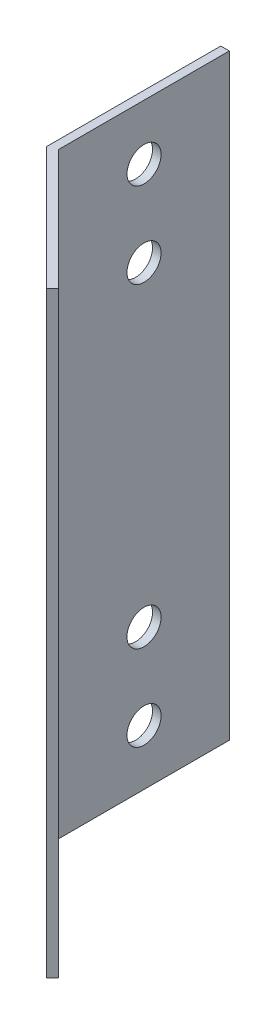
ISO-10303-21;
HEADER;
FILE_DESCRIPTION(('STEP AP214'),'2;1');
FILE_NAME('part.step','',(''),(''),'','','');
FILE_SCHEMA(('AUTOMOTIVE_DESIGN { 1 0 10303 214 1 1 1 1 }'));
ENDSEC;
DATA;
#1=APPLICATION_CONTEXT('core data for automotive mechanical design processes');
#2=APPLICATION_PROTOCOL_DEFINITION('international standard','automotive_design',2000,#1);
#3=PRODUCT_CONTEXT('',#1,'mechanical');
#4=PRODUCT('Part','Part','',(#3));
#5=PRODUCT_RELATED_PRODUCT_CATEGORY('part','',(#4));
#6=PRODUCT_DEFINITION_FORMATION('','',#4);
#7=PRODUCT_DEFINITION_CONTEXT('part definition',#1,'design');
#8=PRODUCT_DEFINITION('design','',#6,#7);
#9=PRODUCT_DEFINITION_SHAPE('','',#8);
#10=(LENGTH_UNIT() NAMED_UNIT(*) SI_UNIT(.MILLI.,.METRE.));
#11=(NAMED_UNIT(*) PLANE_ANGLE_UNIT() SI_UNIT($,.RADIAN.));
#12=(NAMED_UNIT(*) SI_UNIT($,.STERADIAN.) SOLID_ANGLE_UNIT());
#13=UNCERTAINTY_MEASURE_WITH_UNIT(LENGTH_MEASURE(1.E-05),#10,'distance_accuracy_value','');
#14=(GEOMETRIC_REPRESENTATION_CONTEXT(3) GLOBAL_UNCERTAINTY_ASSIGNED_CONTEXT((#13)) GLOBAL_UNIT_ASSIGNED_CONTEXT((#10,
#11,#12)) REPRESENTATION_CONTEXT('',''));
#15=CARTESIAN_POINT('',(0.,0.,0.));
#16=DIRECTION('',(0.,0.,1.));
#17=DIRECTION('',(1.,0.,0.));
#18=AXIS2_PLACEMENT_3D('',#15,#16,#17);
#19=CARTESIAN_POINT('',(14.4350288425444,70.,14.4350288425444));
#20=DIRECTION('',(0.707106781186546,0.,-0.707106781186549));
#21=DIRECTION('',(-0.707106781186549,0.,-0.707106781186546));
#22=AXIS2_PLACEMENT_3D('',#19,#20,#21);
#23=PLANE('',#22);
#24=CARTESIAN_POINT('',(7.36396103067895,16.5,7.36396103067892));
#25=DIRECTION('',(0.707106781186546,0.,-0.707106781186549));
#26=DIRECTION('',(-0.707106781186549,0.,-0.707106781186546));
#27=AXIS2_PLACEMENT_3D('',#24,#25,#26);
#28=CIRCLE('',#27,2.);
#29=CARTESIAN_POINT('',(5.94974746830585,16.5,5.94974746830583));
#30=VERTEX_POINT('',#29);
#31=EDGE_CURVE('E161',#30,#30,#28,.F.);
#32=ORIENTED_EDGE('',*,*,#31,.F.);
#33=EDGE_LOOP('',(#32));
#34=FACE_BOUND('',#33,.T.);
#35=CARTESIAN_POINT('',(7.36396103067895,6.50000000000001,7.36396103067892));
#36=DIRECTION('',(0.707106781186546,0.,-0.707106781186549));
#37=DIRECTION('',(-0.707106781186549,0.,-0.707106781186546));
#38=AXIS2_PLACEMENT_3D('',#35,#36,#37);
#39=CIRCLE('',#38,2.);
#40=CARTESIAN_POINT('',(5.94974746830585,6.50000000000001,5.94974746830583));
#41=VERTEX_POINT('',#40);
#42=EDGE_CURVE('E165',#41,#41,#39,.F.);
#43=ORIENTED_EDGE('',*,*,#42,.F.);
#44=EDGE_LOOP('',(#43));
#45=FACE_BOUND('',#44,.T.);
#46=CARTESIAN_POINT('',(7.36396103067895,63.5,7.36396103067892));
#47=DIRECTION('',(0.707106781186546,0.,-0.707106781186549));
#48=DIRECTION('',(-0.707106781186549,0.,-0.707106781186546));
#49=AXIS2_PLACEMENT_3D('',#46,#47,#48);
#50=CIRCLE('',#49,2.);
#51=CARTESIAN_POINT('',(5.94974746830585,63.5,5.94974746830583));
#52=VERTEX_POINT('',#51);
#53=EDGE_CURVE('E169',#52,#52,#50,.F.);
#54=ORIENTED_EDGE('',*,*,#53,.F.);
#55=EDGE_LOOP('',(#54));
#56=FACE_BOUND('',#55,.T.);
#57=CARTESIAN_POINT('',(7.36396103067895,53.5,7.36396103067892));
#58=DIRECTION('',(0.707106781186546,0.,-0.707106781186549));
#59=DIRECTION('',(-0.707106781186549,0.,-0.707106781186546));
#60=AXIS2_PLACEMENT_3D('',#57,#58,#59);
#61=CIRCLE('',#60,2.);
#62=CARTESIAN_POINT('',(5.94974746830585,53.5,5.94974746830583));
#63=VERTEX_POINT('',#62);
#64=EDGE_CURVE('E172',#63,#63,#61,.F.);
#65=ORIENTED_EDGE('',*,*,#64,.F.);
#66=EDGE_LOOP('',(#65));
#67=FACE_BOUND('',#66,.T.);
#68=DIRECTION('',(0.707106781186549,0.,0.707106781186546));
#69=VECTOR('',#68,1.);
#70=CARTESIAN_POINT('',(14.4350288425444,0.,14.4350288425444));
#71=LINE('',#70,#69);
#72=CARTESIAN_POINT('',(0.,0.,0.));
#73=VERTEX_POINT('',#72);
#74=CARTESIAN_POINT('',(14.4350288425444,0.,14.4350288425444));
#75=VERTEX_POINT('',#74);
#76=EDGE_CURVE('E115',#73,#75,#71,.T.);
#77=ORIENTED_EDGE('',*,*,#76,.T.);
#78=DIRECTION('',(0.,-1.,0.));
#79=VECTOR('',#78,1.);
#80=CARTESIAN_POINT('',(14.4350288425444,70.,14.4350288425444));
#81=LINE('',#80,#79);
#82=CARTESIAN_POINT('',(14.4350288425444,70.,14.4350288425444));
#83=VERTEX_POINT('',#82);
#84=EDGE_CURVE('E11',#83,#75,#81,.T.);
#85=ORIENTED_EDGE('',*,*,#84,.F.);
#86=DIRECTION('',(0.707106781186549,0.,0.707106781186546));
#87=VECTOR('',#86,1.);
#88=CARTESIAN_POINT('',(14.4350288425444,70.,14.4350288425444));
#89=LINE('',#88,#87);
#90=CARTESIAN_POINT('',(0.,70.,0.));
#91=VERTEX_POINT('',#90);
#92=EDGE_CURVE('E126',#91,#83,#89,.T.);
#93=ORIENTED_EDGE('',*,*,#92,.F.);
#94=DIRECTION('',(0.,-1.,0.));
#95=VECTOR('',#94,1.);
#96=CARTESIAN_POINT('',(0.,70.,0.));
#97=LINE('',#96,#95);
#98=EDGE_CURVE('E111',#91,#73,#97,.T.);
#99=ORIENTED_EDGE('',*,*,#98,.T.);
#100=EDGE_LOOP('',(#77,#85,#93,#99));
#101=FACE_BOUND('',#100,.T.);
#102=ADVANCED_FACE('F31',(#34,#45,#56,#67,#101),#23,.F.);
#103=CARTESIAN_POINT('',(15.142135623731,70.,13.7279220613578));
#104=DIRECTION('',(-0.707106781186548,0.,-0.707106781186548));
#105=DIRECTION('',(-0.707106781186548,0.,0.707106781186548));
#106=AXIS2_PLACEMENT_3D('',#103,#104,#105);
#107=PLANE('',#106);
#108=DIRECTION('',(0.707106781186548,0.,-0.707106781186548));
#109=VECTOR('',#108,1.);
#110=CARTESIAN_POINT('',(15.142135623731,0.,13.7279220613578));
#111=LINE('',#110,#109);
#112=CARTESIAN_POINT('',(15.142135623731,0.,13.7279220613578));
#113=VERTEX_POINT('',#112);
#114=EDGE_CURVE('E118',#75,#113,#111,.T.);
#115=ORIENTED_EDGE('',*,*,#114,.T.);
#116=DIRECTION('',(0.,-1.,0.));
#117=VECTOR('',#116,1.);
#118=CARTESIAN_POINT('',(15.142135623731,70.,13.7279220613578));
#119=LINE('',#118,#117);
#120=CARTESIAN_POINT('',(15.142135623731,70.,13.7279220613578));
#121=VERTEX_POINT('',#120);
#122=EDGE_CURVE('E39',#121,#113,#119,.T.);
#123=ORIENTED_EDGE('',*,*,#122,.F.);
#124=DIRECTION('',(0.707106781186548,0.,-0.707106781186548));
#125=VECTOR('',#124,1.);
#126=CARTESIAN_POINT('',(15.142135623731,70.,13.7279220613578));
#127=LINE('',#126,#125);
#128=EDGE_CURVE('E84',#83,#121,#127,.T.);
#129=ORIENTED_EDGE('',*,*,#128,.F.);
#130=ORIENTED_EDGE('',*,*,#84,.T.);
#131=EDGE_LOOP('',(#115,#123,#129,#130));
#132=FACE_BOUND('',#131,.T.);
#133=ADVANCED_FACE('F153',(#132),#107,.F.);
#134=CARTESIAN_POINT('',(1.,70.,-0.414213562373093));
#135=DIRECTION('',(-0.707106781186546,0.,0.707106781186549));
#136=DIRECTION('',(0.707106781186549,0.,0.707106781186546));
#137=AXIS2_PLACEMENT_3D('',#134,#135,#136);
#138=PLANE('',#137);
#139=CARTESIAN_POINT('',(8.0710678118655,16.5,6.65685424949237));
#140=DIRECTION('',(0.707106781186546,0.,-0.707106781186549));
#141=DIRECTION('',(0.707106781186549,0.,0.707106781186546));
#142=AXIS2_PLACEMENT_3D('',#139,#140,#141);
#143=CIRCLE('',#142,2.);
#144=CARTESIAN_POINT('',(9.48528137423859,16.5,8.07106781186546));
#145=VERTEX_POINT('',#144);
#146=EDGE_CURVE('E247',#145,#145,#143,.T.);
#147=ORIENTED_EDGE('',*,*,#146,.F.);
#148=EDGE_LOOP('',(#147));
#149=FACE_BOUND('',#148,.T.);
#150=CARTESIAN_POINT('',(8.0710678118655,6.50000000000001,6.65685424949237));
#151=DIRECTION('',(0.707106781186546,0.,-0.707106781186549));
#152=DIRECTION('',(0.707106781186549,0.,0.707106781186546));
#153=AXIS2_PLACEMENT_3D('',#150,#151,#152);
#154=CIRCLE('',#153,2.);
#155=CARTESIAN_POINT('',(9.48528137423859,6.50000000000001,8.07106781186546));
#156=VERTEX_POINT('',#155);
#157=EDGE_CURVE('E248',#156,#156,#154,.T.);
#158=ORIENTED_EDGE('',*,*,#157,.F.);
#159=EDGE_LOOP('',(#158));
#160=FACE_BOUND('',#159,.T.);
#161=CARTESIAN_POINT('',(8.0710678118655,63.5,6.65685424949237));
#162=DIRECTION('',(0.707106781186546,0.,-0.707106781186549));
#163=DIRECTION('',(-0.707106781186549,0.,-0.707106781186546));
#164=AXIS2_PLACEMENT_3D('',#161,#162,#163);
#165=CIRCLE('',#164,2.);
#166=CARTESIAN_POINT('',(6.6568542494924,63.5,5.24264068711928));
#167=VERTEX_POINT('',#166);
#168=EDGE_CURVE('E255',#167,#167,#165,.T.);
#169=ORIENTED_EDGE('',*,*,#168,.F.);
#170=EDGE_LOOP('',(#169));
#171=FACE_BOUND('',#170,.T.);
#172=CARTESIAN_POINT('',(8.0710678118655,53.5,6.65685424949237));
#173=DIRECTION('',(0.707106781186546,0.,-0.707106781186549));
#174=DIRECTION('',(-0.707106781186549,0.,-0.707106781186546));
#175=AXIS2_PLACEMENT_3D('',#172,#173,#174);
#176=CIRCLE('',#175,2.);
#177=CARTESIAN_POINT('',(6.6568542494924,53.5,5.24264068711928));
#178=VERTEX_POINT('',#177);
#179=EDGE_CURVE('E175',#178,#178,#176,.T.);
#180=ORIENTED_EDGE('',*,*,#179,.F.);
#181=EDGE_LOOP('',(#180));
#182=FACE_BOUND('',#181,.T.);
#183=DIRECTION('',(-0.707106781186549,0.,-0.707106781186546));
#184=VECTOR('',#183,1.);
#185=CARTESIAN_POINT('',(1.,0.,-0.414213562373093));
#186=LINE('',#185,#184);
#187=CARTESIAN_POINT('',(1.,0.,-0.414213562373093));
#188=VERTEX_POINT('',#187);
#189=EDGE_CURVE('E121',#113,#188,#186,.T.);
#190=ORIENTED_EDGE('',*,*,#189,.T.);
#191=DIRECTION('',(0.,-1.,0.));
#192=VECTOR('',#191,1.);
#193=CARTESIAN_POINT('',(1.,70.,-0.414213562373093));
#194=LINE('',#193,#192);
#195=CARTESIAN_POINT('',(1.,70.,-0.414213562373093));
#196=VERTEX_POINT('',#195);
#197=EDGE_CURVE('E106',#196,#188,#194,.T.);
#198=ORIENTED_EDGE('',*,*,#197,.F.);
#199=DIRECTION('',(-0.707106781186549,0.,-0.707106781186546));
#200=VECTOR('',#199,1.);
#201=CARTESIAN_POINT('',(1.,70.,-0.414213562373093));
#202=LINE('',#201,#200);
#203=EDGE_CURVE('E97',#121,#196,#202,.T.);
#204=ORIENTED_EDGE('',*,*,#203,.F.);
#205=ORIENTED_EDGE('',*,*,#122,.T.);
#206=EDGE_LOOP('',(#190,#198,#204,#205));
#207=FACE_BOUND('',#206,.T.);
#208=ADVANCED_FACE('F132',(#149,#160,#171,#182,#207),#138,.F.);
#209=CARTESIAN_POINT('',(1.,70.,-20.4142135623731));
#210=DIRECTION('',(-1.,0.,0.));
#211=DIRECTION('',(0.,0.,1.));
#212=AXIS2_PLACEMENT_3D('',#209,#210,#211);
#213=PLANE('',#212);
#214=CARTESIAN_POINT('',(1.,63.5,-10.4142135623731));
#215=DIRECTION('',(1.,0.,0.));
#216=DIRECTION('',(0.,0.,1.));
#217=AXIS2_PLACEMENT_3D('',#214,#215,#216);
#218=CIRCLE('',#217,2.);
#219=CARTESIAN_POINT('',(1.,63.5,-8.41421356237309));
#220=VERTEX_POINT('',#219);
#221=EDGE_CURVE('E174',#220,#220,#218,.T.);
#222=ORIENTED_EDGE('',*,*,#221,.F.);
#223=EDGE_LOOP('',(#222));
#224=FACE_BOUND('',#223,.T.);
#225=CARTESIAN_POINT('',(1.,53.5,-10.4142135623731));
#226=DIRECTION('',(1.,0.,0.));
#227=DIRECTION('',(0.,0.,1.));
#228=AXIS2_PLACEMENT_3D('',#225,#226,#227);
#229=CIRCLE('',#228,2.);
#230=CARTESIAN_POINT('',(1.,53.5,-8.41421356237309));
#231=VERTEX_POINT('',#230);
#232=EDGE_CURVE('E186',#231,#231,#229,.T.);
#233=ORIENTED_EDGE('',*,*,#232,.F.);
#234=EDGE_LOOP('',(#233));
#235=FACE_BOUND('',#234,.T.);
#236=CARTESIAN_POINT('',(1.,6.5,-10.4142135623731));
#237=DIRECTION('',(1.,0.,0.));
#238=DIRECTION('',(0.,0.,-1.));
#239=AXIS2_PLACEMENT_3D('',#236,#237,#238);
#240=CIRCLE('',#239,2.);
#241=CARTESIAN_POINT('',(1.,6.5,-12.4142135623731));
#242=VERTEX_POINT('',#241);
#243=EDGE_CURVE('E192',#242,#242,#240,.T.);
#244=ORIENTED_EDGE('',*,*,#243,.F.);
#245=EDGE_LOOP('',(#244));
#246=FACE_BOUND('',#245,.T.);
#247=CARTESIAN_POINT('',(1.,16.5,-10.4142135623731));
#248=DIRECTION('',(1.,0.,0.));
#249=DIRECTION('',(0.,0.,-1.));
#250=AXIS2_PLACEMENT_3D('',#247,#248,#249);
#251=CIRCLE('',#250,2.);
#252=CARTESIAN_POINT('',(1.,16.5,-12.4142135623731));
#253=VERTEX_POINT('',#252);
#254=EDGE_CURVE('E198',#253,#253,#251,.T.);
#255=ORIENTED_EDGE('',*,*,#254,.F.);
#256=EDGE_LOOP('',(#255));
#257=FACE_BOUND('',#256,.T.);
#258=DIRECTION('',(0.,0.,-1.));
#259=VECTOR('',#258,1.);
#260=CARTESIAN_POINT('',(1.,0.,-20.4142135623731));
#261=LINE('',#260,#259);
#262=CARTESIAN_POINT('',(1.,0.,-20.4142135623731));
#263=VERTEX_POINT('',#262);
#264=EDGE_CURVE('E105',#188,#263,#261,.T.);
#265=ORIENTED_EDGE('',*,*,#264,.T.);
#266=DIRECTION('',(0.,-1.,0.));
#267=VECTOR('',#266,1.);
#268=CARTESIAN_POINT('',(1.,70.,-20.4142135623731));
#269=LINE('',#268,#267);
#270=CARTESIAN_POINT('',(1.,70.,-20.4142135623731));
#271=VERTEX_POINT('',#270);
#272=EDGE_CURVE('E102',#271,#263,#269,.T.);
#273=ORIENTED_EDGE('',*,*,#272,.F.);
#274=DIRECTION('',(0.,0.,-1.));
#275=VECTOR('',#274,1.);
#276=CARTESIAN_POINT('',(1.,70.,-20.4142135623731));
#277=LINE('',#276,#275);
#278=EDGE_CURVE('E91',#196,#271,#277,.T.);
#279=ORIENTED_EDGE('',*,*,#278,.F.);
#280=ORIENTED_EDGE('',*,*,#197,.T.);
#281=EDGE_LOOP('',(#265,#273,#279,#280));
#282=FACE_BOUND('',#281,.T.);
#283=ADVANCED_FACE('F103',(#224,#235,#246,#257,#282),#213,.F.);
#284=CARTESIAN_POINT('',(0.,70.,-20.4142135623731));
#285=DIRECTION('',(0.,0.,1.));
#286=DIRECTION('',(1.,0.,0.));
#287=AXIS2_PLACEMENT_3D('',#284,#285,#286);
#288=PLANE('',#287);
#289=DIRECTION('',(-1.,0.,0.));
#290=VECTOR('',#289,1.);
#291=CARTESIAN_POINT('',(0.,0.,-20.4142135623731));
#292=LINE('',#291,#290);
#293=CARTESIAN_POINT('',(0.,0.,-20.4142135623731));
#294=VERTEX_POINT('',#293);
#295=EDGE_CURVE('E70',#263,#294,#292,.T.);
#296=ORIENTED_EDGE('',*,*,#295,.T.);
#297=DIRECTION('',(0.,-1.,0.));
#298=VECTOR('',#297,1.);
#299=CARTESIAN_POINT('',(0.,70.,-20.4142135623731));
#300=LINE('',#299,#298);
#301=CARTESIAN_POINT('',(0.,70.,-20.4142135623731));
#302=VERTEX_POINT('',#301);
#303=EDGE_CURVE('E107',#302,#294,#300,.T.);
#304=ORIENTED_EDGE('',*,*,#303,.F.);
#305=DIRECTION('',(-1.,0.,0.));
#306=VECTOR('',#305,1.);
#307=CARTESIAN_POINT('',(0.,70.,-20.4142135623731));
#308=LINE('',#307,#306);
#309=EDGE_CURVE('E95',#271,#302,#308,.T.);
#310=ORIENTED_EDGE('',*,*,#309,.F.);
#311=ORIENTED_EDGE('',*,*,#272,.T.);
#312=EDGE_LOOP('',(#296,#304,#310,#311));
#313=FACE_BOUND('',#312,.T.);
#314=ADVANCED_FACE('F109',(#313),#288,.F.);
#315=CARTESIAN_POINT('',(0.,70.,0.));
#316=DIRECTION('',(1.,0.,0.));
#317=DIRECTION('',(0.,0.,-1.));
#318=AXIS2_PLACEMENT_3D('',#315,#316,#317);
#319=PLANE('',#318);
#320=CARTESIAN_POINT('',(0.,63.5,-10.4142135623731));
#321=DIRECTION('',(1.,0.,0.));
#322=DIRECTION('',(0.,0.,-1.));
#323=AXIS2_PLACEMENT_3D('',#320,#321,#322);
#324=CIRCLE('',#323,2.);
#325=CARTESIAN_POINT('',(0.,63.5,-12.4142135623731));
#326=VERTEX_POINT('',#325);
#327=EDGE_CURVE('E178',#326,#326,#324,.F.);
#328=ORIENTED_EDGE('',*,*,#327,.F.);
#329=EDGE_LOOP('',(#328));
#330=FACE_BOUND('',#329,.T.);
#331=CARTESIAN_POINT('',(0.,53.5,-10.4142135623731));
#332=DIRECTION('',(1.,0.,0.));
#333=DIRECTION('',(0.,0.,-1.));
#334=AXIS2_PLACEMENT_3D('',#331,#332,#333);
#335=CIRCLE('',#334,2.);
#336=CARTESIAN_POINT('',(0.,53.5,-12.4142135623731));
#337=VERTEX_POINT('',#336);
#338=EDGE_CURVE('E189',#337,#337,#335,.F.);
#339=ORIENTED_EDGE('',*,*,#338,.F.);
#340=EDGE_LOOP('',(#339));
#341=FACE_BOUND('',#340,.T.);
#342=CARTESIAN_POINT('',(0.,6.5,-10.4142135623731));
#343=DIRECTION('',(1.,0.,0.));
#344=DIRECTION('',(0.,0.,-1.));
#345=AXIS2_PLACEMENT_3D('',#342,#343,#344);
#346=CIRCLE('',#345,2.);
#347=CARTESIAN_POINT('',(0.,6.5,-12.4142135623731));
#348=VERTEX_POINT('',#347);
#349=EDGE_CURVE('E195',#348,#348,#346,.F.);
#350=ORIENTED_EDGE('',*,*,#349,.F.);
#351=EDGE_LOOP('',(#350));
#352=FACE_BOUND('',#351,.T.);
#353=CARTESIAN_POINT('',(0.,16.5,-10.4142135623731));
#354=DIRECTION('',(1.,0.,0.));
#355=DIRECTION('',(0.,0.,-1.));
#356=AXIS2_PLACEMENT_3D('',#353,#354,#355);
#357=CIRCLE('',#356,2.);
#358=CARTESIAN_POINT('',(0.,16.5,-12.4142135623731));
#359=VERTEX_POINT('',#358);
#360=EDGE_CURVE('E119',#359,#359,#357,.F.);
#361=ORIENTED_EDGE('',*,*,#360,.F.);
#362=EDGE_LOOP('',(#361));
#363=FACE_BOUND('',#362,.T.);
#364=DIRECTION('',(0.,0.,1.));
#365=VECTOR('',#364,1.);
#366=CARTESIAN_POINT('',(0.,0.,0.));
#367=LINE('',#366,#365);
#368=EDGE_CURVE('E76',#294,#73,#367,.T.);
#369=ORIENTED_EDGE('',*,*,#368,.T.);
#370=ORIENTED_EDGE('',*,*,#98,.F.);
#371=DIRECTION('',(0.,0.,1.));
#372=VECTOR('',#371,1.);
#373=CARTESIAN_POINT('',(0.,70.,0.));
#374=LINE('',#373,#372);
#375=EDGE_CURVE('E47',#302,#91,#374,.T.);
#376=ORIENTED_EDGE('',*,*,#375,.F.);
#377=ORIENTED_EDGE('',*,*,#303,.T.);
#378=EDGE_LOOP('',(#369,#370,#376,#377));
#379=FACE_BOUND('',#378,.T.);
#380=ADVANCED_FACE('F139',(#330,#341,#352,#363,#379),#319,.F.);
#381=CARTESIAN_POINT('',(14.4350288425444,70.,14.4350288425444));
#382=DIRECTION('',(0.,1.,0.));
#383=DIRECTION('',(0.,0.,1.));
#384=AXIS2_PLACEMENT_3D('',#381,#382,#383);
#385=PLANE('',#384);
#386=ORIENTED_EDGE('',*,*,#92,.T.);
#387=ORIENTED_EDGE('',*,*,#128,.T.);
#388=ORIENTED_EDGE('',*,*,#203,.T.);
#389=ORIENTED_EDGE('',*,*,#278,.T.);
#390=ORIENTED_EDGE('',*,*,#309,.T.);
#391=ORIENTED_EDGE('',*,*,#375,.T.);
#392=EDGE_LOOP('',(#386,#387,#388,#389,#390,#391));
#393=FACE_BOUND('',#392,.T.);
#394=ADVANCED_FACE('F93',(#393),#385,.T.);
#395=CARTESIAN_POINT('',(14.4350288425444,0.,14.4350288425444));
#396=DIRECTION('',(0.,1.,0.));
#397=DIRECTION('',(0.,0.,1.));
#398=AXIS2_PLACEMENT_3D('',#395,#396,#397);
#399=PLANE('',#398);
#400=ORIENTED_EDGE('',*,*,#76,.F.);
#401=ORIENTED_EDGE('',*,*,#368,.F.);
#402=ORIENTED_EDGE('',*,*,#295,.F.);
#403=ORIENTED_EDGE('',*,*,#264,.F.);
#404=ORIENTED_EDGE('',*,*,#189,.F.);
#405=ORIENTED_EDGE('',*,*,#114,.F.);
#406=EDGE_LOOP('',(#400,#401,#402,#403,#404,#405));
#407=FACE_BOUND('',#406,.T.);
#408=ADVANCED_FACE('F135',(#407),#399,.F.);
#409=CARTESIAN_POINT('',(-0.00100000000000273,16.5,-10.4142135623731));
#410=DIRECTION('',(1.,0.,0.));
#411=DIRECTION('',(0.,0.,-1.));
#412=AXIS2_PLACEMENT_3D('',#409,#410,#411);
#413=CYLINDRICAL_SURFACE('',#412,2.);
#414=ORIENTED_EDGE('',*,*,#254,.T.);
#415=EDGE_LOOP('',(#414));
#416=FACE_BOUND('',#415,.T.);
#417=ORIENTED_EDGE('',*,*,#360,.T.);
#418=EDGE_LOOP('',(#417));
#419=FACE_BOUND('',#418,.T.);
#420=ADVANCED_FACE('F206',(#416,#419),#413,.F.);
#421=CARTESIAN_POINT('',(-0.00100000000000273,6.5,-10.4142135623731));
#422=DIRECTION('',(1.,0.,0.));
#423=DIRECTION('',(0.,0.,-1.));
#424=AXIS2_PLACEMENT_3D('',#421,#422,#423);
#425=CYLINDRICAL_SURFACE('',#424,2.);
#426=ORIENTED_EDGE('',*,*,#243,.T.);
#427=EDGE_LOOP('',(#426));
#428=FACE_BOUND('',#427,.T.);
#429=ORIENTED_EDGE('',*,*,#349,.T.);
#430=EDGE_LOOP('',(#429));
#431=FACE_BOUND('',#430,.T.);
#432=ADVANCED_FACE('F209',(#428,#431),#425,.F.);
#433=CARTESIAN_POINT('',(-0.00100000000000273,53.5,-10.4142135623731));
#434=DIRECTION('',(1.,0.,0.));
#435=DIRECTION('',(0.,0.,-1.));
#436=AXIS2_PLACEMENT_3D('',#433,#434,#435);
#437=CYLINDRICAL_SURFACE('',#436,2.);
#438=ORIENTED_EDGE('',*,*,#232,.T.);
#439=EDGE_LOOP('',(#438));
#440=FACE_BOUND('',#439,.T.);
#441=ORIENTED_EDGE('',*,*,#338,.T.);
#442=EDGE_LOOP('',(#441));
#443=FACE_BOUND('',#442,.T.);
#444=ADVANCED_FACE('F216',(#440,#443),#437,.F.);
#445=CARTESIAN_POINT('',(-0.00100000000000273,63.5,-10.4142135623731));
#446=DIRECTION('',(1.,0.,0.));
#447=DIRECTION('',(0.,0.,-1.));
#448=AXIS2_PLACEMENT_3D('',#445,#446,#447);
#449=CYLINDRICAL_SURFACE('',#448,2.);
#450=ORIENTED_EDGE('',*,*,#221,.T.);
#451=EDGE_LOOP('',(#450));
#452=FACE_BOUND('',#451,.T.);
#453=ORIENTED_EDGE('',*,*,#327,.T.);
#454=EDGE_LOOP('',(#453));
#455=FACE_BOUND('',#454,.T.);
#456=ADVANCED_FACE('F222',(#452,#455),#449,.F.);
#457=CARTESIAN_POINT('',(0.145446609406763,53.5,14.5824754519511));
#458=DIRECTION('',(0.707106781186546,0.,-0.707106781186549));
#459=DIRECTION('',(-0.707106781186549,0.,-0.707106781186546));
#460=AXIS2_PLACEMENT_3D('',#457,#458,#459);
#461=CYLINDRICAL_SURFACE('',#460,2.);
#462=ORIENTED_EDGE('',*,*,#179,.T.);
#463=EDGE_LOOP('',(#462));
#464=FACE_BOUND('',#463,.T.);
#465=ORIENTED_EDGE('',*,*,#64,.T.);
#466=EDGE_LOOP('',(#465));
#467=FACE_BOUND('',#466,.T.);
#468=ADVANCED_FACE('F226',(#464,#467),#461,.F.);
#469=CARTESIAN_POINT('',(0.145446609406765,63.5,14.5824754519511));
#470=DIRECTION('',(0.707106781186546,0.,-0.707106781186549));
#471=DIRECTION('',(-0.707106781186549,0.,-0.707106781186546));
#472=AXIS2_PLACEMENT_3D('',#469,#470,#471);
#473=CYLINDRICAL_SURFACE('',#472,2.);
#474=ORIENTED_EDGE('',*,*,#168,.T.);
#475=EDGE_LOOP('',(#474));
#476=FACE_BOUND('',#475,.T.);
#477=ORIENTED_EDGE('',*,*,#53,.T.);
#478=EDGE_LOOP('',(#477));
#479=FACE_BOUND('',#478,.T.);
#480=ADVANCED_FACE('F230',(#476,#479),#473,.F.);
#481=CARTESIAN_POINT('',(0.145446609406765,6.50000000000001,14.5824754519511));
#482=DIRECTION('',(0.707106781186546,0.,-0.707106781186549));
#483=DIRECTION('',(-0.707106781186549,0.,-0.707106781186546));
#484=AXIS2_PLACEMENT_3D('',#481,#482,#483);
#485=CYLINDRICAL_SURFACE('',#484,2.);
#486=ORIENTED_EDGE('',*,*,#157,.T.);
#487=EDGE_LOOP('',(#486));
#488=FACE_BOUND('',#487,.T.);
#489=ORIENTED_EDGE('',*,*,#42,.T.);
#490=EDGE_LOOP('',(#489));
#491=FACE_BOUND('',#490,.T.);
#492=ADVANCED_FACE('F234',(#488,#491),#485,.F.);
#493=CARTESIAN_POINT('',(0.145446609406763,16.5,14.5824754519511));
#494=DIRECTION('',(0.707106781186546,0.,-0.707106781186549));
#495=DIRECTION('',(-0.707106781186549,0.,-0.707106781186546));
#496=AXIS2_PLACEMENT_3D('',#493,#494,#495);
#497=CYLINDRICAL_SURFACE('',#496,2.);
#498=ORIENTED_EDGE('',*,*,#146,.T.);
#499=EDGE_LOOP('',(#498));
#500=FACE_BOUND('',#499,.T.);
#501=ORIENTED_EDGE('',*,*,#31,.T.);
#502=EDGE_LOOP('',(#501));
#503=FACE_BOUND('',#502,.T.);
#504=ADVANCED_FACE('F238',(#500,#503),#497,.F.);
#505=CLOSED_SHELL('',(#102,#133,#208,#283,#314,#380,#394,#408,#420,#432,#444,#456,#468,#480,
#492,#504));
#506=MANIFOLD_SOLID_BREP('B2',#505);
#507=ADVANCED_BREP_SHAPE_REPRESENTATION('',(#18,#506),#14);
#508=SHAPE_DEFINITION_REPRESENTATION(#9,#507);
ENDSEC;
END-ISO-10303-21;
